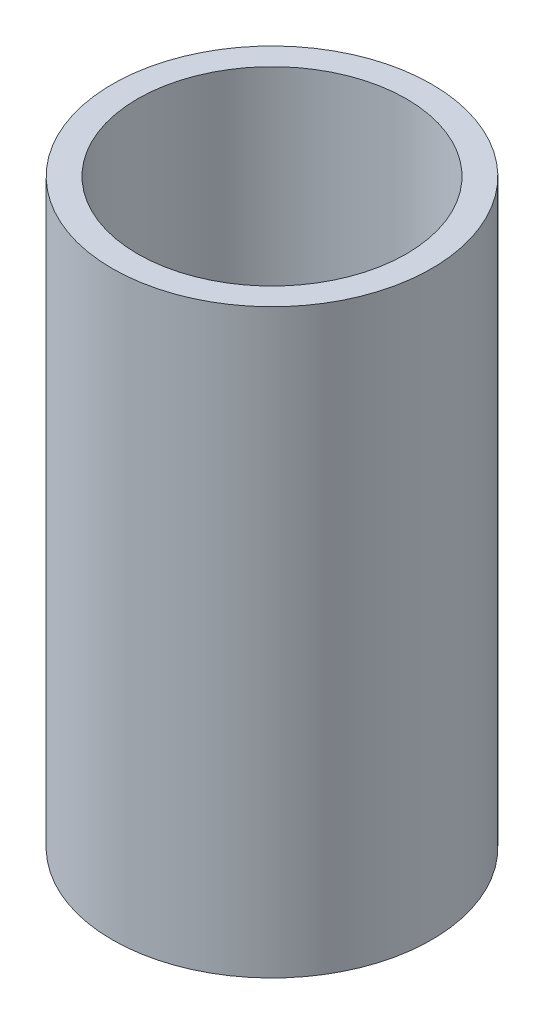
ISO-10303-21;
HEADER;
FILE_DESCRIPTION(('STEP AP214'),'2;1');
FILE_NAME('part.step','',(''),(''),'','','');
FILE_SCHEMA(('AUTOMOTIVE_DESIGN { 1 0 10303 214 1 1 1 1 }'));
ENDSEC;
DATA;
#1=APPLICATION_CONTEXT('core data for automotive mechanical design processes');
#2=APPLICATION_PROTOCOL_DEFINITION('international standard','automotive_design',2000,#1);
#3=PRODUCT_CONTEXT('',#1,'mechanical');
#4=PRODUCT('Part','Part','',(#3));
#5=PRODUCT_RELATED_PRODUCT_CATEGORY('part','',(#4));
#6=PRODUCT_DEFINITION_FORMATION('','',#4);
#7=PRODUCT_DEFINITION_CONTEXT('part definition',#1,'design');
#8=PRODUCT_DEFINITION('design','',#6,#7);
#9=PRODUCT_DEFINITION_SHAPE('','',#8);
#10=(LENGTH_UNIT() NAMED_UNIT(*) SI_UNIT(.MILLI.,.METRE.));
#11=(NAMED_UNIT(*) PLANE_ANGLE_UNIT() SI_UNIT($,.RADIAN.));
#12=(NAMED_UNIT(*) SI_UNIT($,.STERADIAN.) SOLID_ANGLE_UNIT());
#13=UNCERTAINTY_MEASURE_WITH_UNIT(LENGTH_MEASURE(1.E-05),#10,'distance_accuracy_value','');
#14=(GEOMETRIC_REPRESENTATION_CONTEXT(3) GLOBAL_UNCERTAINTY_ASSIGNED_CONTEXT((#13)) GLOBAL_UNIT_ASSIGNED_CONTEXT((#10,
#11,#12)) REPRESENTATION_CONTEXT('',''));
#15=CARTESIAN_POINT('',(0.,0.,0.));
#16=DIRECTION('',(0.,0.,1.));
#17=DIRECTION('',(1.,0.,0.));
#18=AXIS2_PLACEMENT_3D('',#15,#16,#17);
#19=CARTESIAN_POINT('',(0.,109.205464952916,0.));
#20=DIRECTION('',(0.,-1.,0.));
#21=DIRECTION('',(0.,0.,-1.));
#22=AXIS2_PLACEMENT_3D('',#19,#20,#21);
#23=CYLINDRICAL_SURFACE('',#22,30.);
#24=CARTESIAN_POINT('',(0.,109.205464952916,0.));
#25=DIRECTION('',(0.,1.,0.));
#26=DIRECTION('',(0.,0.,1.));
#27=AXIS2_PLACEMENT_3D('',#24,#25,#26);
#28=CIRCLE('',#27,30.);
#29=CARTESIAN_POINT('',(0.,109.205464952916,30.));
#30=VERTEX_POINT('',#29);
#31=EDGE_CURVE('E10',#30,#30,#28,.T.);
#32=ORIENTED_EDGE('',*,*,#31,.F.);
#33=EDGE_LOOP('',(#32));
#34=FACE_BOUND('',#33,.T.);
#35=CARTESIAN_POINT('',(0.,0.,0.));
#36=DIRECTION('',(0.,1.,0.));
#37=DIRECTION('',(0.,0.,1.));
#38=AXIS2_PLACEMENT_3D('',#35,#36,#37);
#39=CIRCLE('',#38,30.);
#40=CARTESIAN_POINT('',(0.,0.,30.));
#41=VERTEX_POINT('',#40);
#42=EDGE_CURVE('E37',#41,#41,#39,.T.);
#43=ORIENTED_EDGE('',*,*,#42,.T.);
#44=EDGE_LOOP('',(#43));
#45=FACE_BOUND('',#44,.T.);
#46=ADVANCED_FACE('F40',(#34,#45),#23,.T.);
#47=CARTESIAN_POINT('',(0.,109.205464952916,0.));
#48=DIRECTION('',(0.,1.,0.));
#49=DIRECTION('',(0.,0.,1.));
#50=AXIS2_PLACEMENT_3D('',#47,#48,#49);
#51=PLANE('',#50);
#52=CARTESIAN_POINT('',(0.,109.205464952916,0.));
#53=DIRECTION('',(0.,1.,0.));
#54=DIRECTION('',(0.,0.,1.));
#55=AXIS2_PLACEMENT_3D('',#52,#53,#54);
#56=CIRCLE('',#55,25.242752207227);
#57=CARTESIAN_POINT('',(0.,109.205464952916,25.242752207227));
#58=VERTEX_POINT('',#57);
#59=EDGE_CURVE('E50',#58,#58,#56,.T.);
#60=ORIENTED_EDGE('',*,*,#59,.F.);
#61=EDGE_LOOP('',(#60));
#62=FACE_BOUND('',#61,.T.);
#63=ORIENTED_EDGE('',*,*,#31,.T.);
#64=EDGE_LOOP('',(#63));
#65=FACE_BOUND('',#64,.T.);
#66=ADVANCED_FACE('F59',(#62,#65),#51,.T.);
#67=CARTESIAN_POINT('',(0.,0.,0.));
#68=DIRECTION('',(0.,1.,0.));
#69=DIRECTION('',(0.,0.,1.));
#70=AXIS2_PLACEMENT_3D('',#67,#68,#69);
#71=PLANE('',#70);
#72=CARTESIAN_POINT('',(0.,0.,0.));
#73=DIRECTION('',(0.,1.,0.));
#74=DIRECTION('',(0.,0.,1.));
#75=AXIS2_PLACEMENT_3D('',#72,#73,#74);
#76=CIRCLE('',#75,25.242752207227);
#77=CARTESIAN_POINT('',(0.,0.,25.242752207227));
#78=VERTEX_POINT('',#77);
#79=EDGE_CURVE('E47',#78,#78,#76,.T.);
#80=ORIENTED_EDGE('',*,*,#79,.T.);
#81=EDGE_LOOP('',(#80));
#82=FACE_BOUND('',#81,.T.);
#83=ORIENTED_EDGE('',*,*,#42,.F.);
#84=EDGE_LOOP('',(#83));
#85=FACE_BOUND('',#84,.T.);
#86=ADVANCED_FACE('F58',(#82,#85),#71,.F.);
#87=CARTESIAN_POINT('',(0.,109.205464952916,0.));
#88=DIRECTION('',(0.,-1.,0.));
#89=DIRECTION('',(0.,0.,-1.));
#90=AXIS2_PLACEMENT_3D('',#87,#88,#89);
#91=CYLINDRICAL_SURFACE('',#90,25.242752207227);
#92=ORIENTED_EDGE('',*,*,#59,.T.);
#93=EDGE_LOOP('',(#92));
#94=FACE_BOUND('',#93,.T.);
#95=ORIENTED_EDGE('',*,*,#79,.F.);
#96=EDGE_LOOP('',(#95));
#97=FACE_BOUND('',#96,.T.);
#98=ADVANCED_FACE('F54',(#94,#97),#91,.F.);
#99=CLOSED_SHELL('',(#46,#66,#86,#98));
#100=MANIFOLD_SOLID_BREP('B2',#99);
#101=ADVANCED_BREP_SHAPE_REPRESENTATION('',(#18,#100),#14);
#102=SHAPE_DEFINITION_REPRESENTATION(#9,#101);
ENDSEC;
END-ISO-10303-21;
